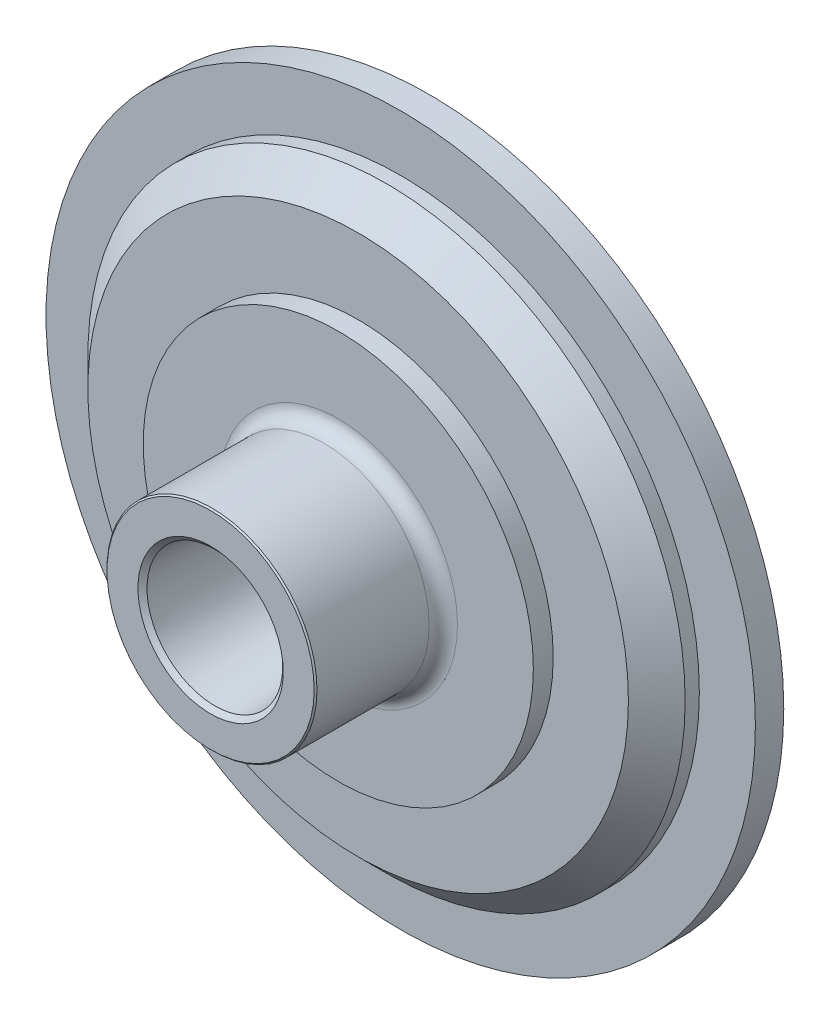
ISO-10303-21;
HEADER;
FILE_DESCRIPTION(('STEP AP214'),'2;1');
FILE_NAME('part.step','',(''),(''),'','','');
FILE_SCHEMA(('AUTOMOTIVE_DESIGN { 1 0 10303 214 1 1 1 1 }'));
ENDSEC;
DATA;
#1=APPLICATION_CONTEXT('core data for automotive mechanical design processes');
#2=APPLICATION_PROTOCOL_DEFINITION('international standard','automotive_design',2000,#1);
#3=PRODUCT_CONTEXT('',#1,'mechanical');
#4=PRODUCT('Part','Part','',(#3));
#5=PRODUCT_RELATED_PRODUCT_CATEGORY('part','',(#4));
#6=PRODUCT_DEFINITION_FORMATION('','',#4);
#7=PRODUCT_DEFINITION_CONTEXT('part definition',#1,'design');
#8=PRODUCT_DEFINITION('design','',#6,#7);
#9=PRODUCT_DEFINITION_SHAPE('','',#8);
#10=(LENGTH_UNIT() NAMED_UNIT(*) SI_UNIT(.MILLI.,.METRE.));
#11=(NAMED_UNIT(*) PLANE_ANGLE_UNIT() SI_UNIT($,.RADIAN.));
#12=(NAMED_UNIT(*) SI_UNIT($,.STERADIAN.) SOLID_ANGLE_UNIT());
#13=UNCERTAINTY_MEASURE_WITH_UNIT(LENGTH_MEASURE(1.E-05),#10,'distance_accuracy_value','');
#14=(GEOMETRIC_REPRESENTATION_CONTEXT(3) GLOBAL_UNCERTAINTY_ASSIGNED_CONTEXT((#13)) GLOBAL_UNIT_ASSIGNED_CONTEXT((#10,
#11,#12)) REPRESENTATION_CONTEXT('',''));
#15=CARTESIAN_POINT('',(0.,0.,0.));
#16=DIRECTION('',(0.,0.,1.));
#17=DIRECTION('',(1.,0.,0.));
#18=AXIS2_PLACEMENT_3D('',#15,#16,#17);
#19=CARTESIAN_POINT('',(0.,35.,-65.4818552334935));
#20=DIRECTION('',(0.,0.,1.));
#21=DIRECTION('',(1.,0.,0.));
#22=AXIS2_PLACEMENT_3D('',#19,#20,#21);
#23=PLANE('',#22);
#24=CARTESIAN_POINT('',(0.,0.,-65.4818552334935));
#25=DIRECTION('',(0.,0.,1.));
#26=DIRECTION('',(1.,0.,0.));
#27=AXIS2_PLACEMENT_3D('',#24,#25,#26);
#28=CIRCLE('',#27,35.);
#29=CARTESIAN_POINT('',(35.,0.,-65.4818552334935));
#30=VERTEX_POINT('',#29);
#31=EDGE_CURVE('E130',#30,#30,#28,.T.);
#32=ORIENTED_EDGE('',*,*,#31,.F.);
#33=EDGE_LOOP('',(#32));
#34=FACE_BOUND('',#33,.T.);
#35=CARTESIAN_POINT('',(0.,0.,-65.4818552334935));
#36=DIRECTION('',(0.,0.,1.));
#37=DIRECTION('',(1.,0.,0.));
#38=AXIS2_PLACEMENT_3D('',#35,#36,#37);
#39=CIRCLE('',#38,20.76);
#40=CARTESIAN_POINT('',(20.76,0.,-65.4818552334935));
#41=VERTEX_POINT('',#40);
#42=EDGE_CURVE('E10',#41,#41,#39,.T.);
#43=ORIENTED_EDGE('',*,*,#42,.T.);
#44=EDGE_LOOP('',(#43));
#45=FACE_BOUND('',#44,.T.);
#46=ADVANCED_FACE('F39',(#34,#45),#23,.F.);
#47=CARTESIAN_POINT('',(0.,0.,-15.9788373758317));
#48=DIRECTION('',(0.,0.,1.));
#49=DIRECTION('',(1.,0.,0.));
#50=AXIS2_PLACEMENT_3D('',#47,#48,#49);
#51=CONICAL_SURFACE('',#50,23.904897605075,0.0634441501961792);
#52=ORIENTED_EDGE('',*,*,#42,.F.);
#53=EDGE_LOOP('',(#52));
#54=FACE_BOUND('',#53,.T.);
#55=CARTESIAN_POINT('',(0.,0.,-15.9788373758317));
#56=DIRECTION('',(0.,0.,1.));
#57=DIRECTION('',(1.,0.,0.));
#58=AXIS2_PLACEMENT_3D('',#55,#56,#57);
#59=CIRCLE('',#58,23.904897605075);
#60=CARTESIAN_POINT('',(23.904897605075,0.,-15.9788373758317));
#61=VERTEX_POINT('',#60);
#62=EDGE_CURVE('E46',#61,#61,#59,.T.);
#63=ORIENTED_EDGE('',*,*,#62,.T.);
#64=EDGE_LOOP('',(#63));
#65=FACE_BOUND('',#64,.T.);
#66=ADVANCED_FACE('F138',(#54,#65),#51,.F.);
#67=CARTESIAN_POINT('',(0.,0.,-14.4818552334935));
#68=DIRECTION('',(0.,0.,1.));
#69=DIRECTION('',(1.,0.,0.));
#70=AXIS2_PLACEMENT_3D('',#67,#68,#69);
#71=CONICAL_SURFACE('',#70,25.6049878772782,0.848842313593626);
#72=ORIENTED_EDGE('',*,*,#62,.F.);
#73=EDGE_LOOP('',(#72));
#74=FACE_BOUND('',#73,.T.);
#75=CARTESIAN_POINT('',(0.,0.,-14.4818552334935));
#76=DIRECTION('',(0.,0.,1.));
#77=DIRECTION('',(1.,0.,0.));
#78=AXIS2_PLACEMENT_3D('',#75,#76,#77);
#79=CIRCLE('',#78,25.6049878772782);
#80=CARTESIAN_POINT('',(25.6049878772782,0.,-14.4818552334935));
#81=VERTEX_POINT('',#80);
#82=EDGE_CURVE('E51',#81,#81,#79,.T.);
#83=ORIENTED_EDGE('',*,*,#82,.T.);
#84=EDGE_LOOP('',(#83));
#85=FACE_BOUND('',#84,.T.);
#86=ADVANCED_FACE('F142',(#74,#85),#71,.F.);
#87=CARTESIAN_POINT('',(0.,25.6049878772782,-14.4818552334935));
#88=DIRECTION('',(0.,0.,-1.));
#89=DIRECTION('',(-1.,0.,0.));
#90=AXIS2_PLACEMENT_3D('',#87,#88,#89);
#91=PLANE('',#90);
#92=ORIENTED_EDGE('',*,*,#82,.F.);
#93=EDGE_LOOP('',(#92));
#94=FACE_BOUND('',#93,.T.);
#95=CARTESIAN_POINT('',(0.,0.,-14.4818552334935));
#96=DIRECTION('',(0.,0.,1.));
#97=DIRECTION('',(1.,0.,0.));
#98=AXIS2_PLACEMENT_3D('',#95,#96,#97);
#99=CIRCLE('',#98,36.5);
#100=CARTESIAN_POINT('',(36.5,0.,-14.4818552334935));
#101=VERTEX_POINT('',#100);
#102=EDGE_CURVE('E56',#101,#101,#99,.T.);
#103=ORIENTED_EDGE('',*,*,#102,.T.);
#104=EDGE_LOOP('',(#103));
#105=FACE_BOUND('',#104,.T.);
#106=ADVANCED_FACE('F147',(#94,#105),#91,.F.);
#107=CARTESIAN_POINT('',(0.,0.,-14.9818552334935));
#108=DIRECTION('',(0.,0.,-1.));
#109=DIRECTION('',(-1.,0.,0.));
#110=AXIS2_PLACEMENT_3D('',#107,#108,#109);
#111=CONICAL_SURFACE('',#110,37.,0.785398163397462);
#112=ORIENTED_EDGE('',*,*,#102,.F.);
#113=EDGE_LOOP('',(#112));
#114=FACE_BOUND('',#113,.T.);
#115=CARTESIAN_POINT('',(0.,0.,-14.9818552334935));
#116=DIRECTION('',(0.,0.,1.));
#117=DIRECTION('',(1.,0.,0.));
#118=AXIS2_PLACEMENT_3D('',#115,#116,#117);
#119=CIRCLE('',#118,37.);
#120=CARTESIAN_POINT('',(37.,0.,-14.9818552334935));
#121=VERTEX_POINT('',#120);
#122=EDGE_CURVE('E62',#121,#121,#119,.T.);
#123=ORIENTED_EDGE('',*,*,#122,.T.);
#124=EDGE_LOOP('',(#123));
#125=FACE_BOUND('',#124,.T.);
#126=ADVANCED_FACE('F153',(#114,#125),#111,.T.);
#127=CARTESIAN_POINT('',(0.,0.,-5.28155086198055));
#128=DIRECTION('',(0.,0.,1.));
#129=DIRECTION('',(1.,0.,0.));
#130=AXIS2_PLACEMENT_3D('',#127,#128,#129);
#131=CYLINDRICAL_SURFACE('',#130,37.);
#132=ORIENTED_EDGE('',*,*,#122,.F.);
#133=EDGE_LOOP('',(#132));
#134=FACE_BOUND('',#133,.T.);
#135=CARTESIAN_POINT('',(0.,0.,-54.4818552334935));
#136=DIRECTION('',(0.,0.,1.));
#137=DIRECTION('',(1.,0.,0.));
#138=AXIS2_PLACEMENT_3D('',#135,#136,#137);
#139=CIRCLE('',#138,37.);
#140=CARTESIAN_POINT('',(37.,0.,-54.4818552334935));
#141=VERTEX_POINT('',#140);
#142=EDGE_CURVE('E66',#141,#141,#139,.T.);
#143=ORIENTED_EDGE('',*,*,#142,.T.);
#144=EDGE_LOOP('',(#143));
#145=FACE_BOUND('',#144,.T.);
#146=ADVANCED_FACE('F157',(#134,#145),#131,.T.);
#147=CARTESIAN_POINT('',(0.,0.,-54.4818552334935));
#148=DIRECTION('',(0.,0.,1.));
#149=DIRECTION('',(1.,0.,0.));
#150=AXIS2_PLACEMENT_3D('',#147,#148,#149);
#151=TOROIDAL_SURFACE('',#150,42.,5.);
#152=ORIENTED_EDGE('',*,*,#142,.F.);
#153=EDGE_LOOP('',(#152));
#154=FACE_BOUND('',#153,.T.);
#155=CARTESIAN_POINT('',(0.,0.,-59.4818552334935));
#156=DIRECTION('',(0.,0.,1.));
#157=DIRECTION('',(1.,0.,0.));
#158=AXIS2_PLACEMENT_3D('',#155,#156,#157);
#159=CIRCLE('',#158,42.);
#160=CARTESIAN_POINT('',(42.,0.,-59.4818552334935));
#161=VERTEX_POINT('',#160);
#162=EDGE_CURVE('E70',#161,#161,#159,.T.);
#163=ORIENTED_EDGE('',*,*,#162,.T.);
#164=EDGE_LOOP('',(#163));
#165=FACE_BOUND('',#164,.T.);
#166=ADVANCED_FACE('F161',(#154,#165),#151,.F.);
#167=CARTESIAN_POINT('',(0.,42.,-59.4818552334935));
#168=DIRECTION('',(0.,0.,-1.));
#169=DIRECTION('',(-1.,0.,0.));
#170=AXIS2_PLACEMENT_3D('',#167,#168,#169);
#171=PLANE('',#170);
#172=ORIENTED_EDGE('',*,*,#162,.F.);
#173=EDGE_LOOP('',(#172));
#174=FACE_BOUND('',#173,.T.);
#175=CARTESIAN_POINT('',(0.,0.,-59.4818552334935));
#176=DIRECTION('',(0.,0.,1.));
#177=DIRECTION('',(1.,0.,0.));
#178=AXIS2_PLACEMENT_3D('',#175,#176,#177);
#179=CIRCLE('',#178,68.75);
#180=CARTESIAN_POINT('',(68.75,0.,-59.4818552334935));
#181=VERTEX_POINT('',#180);
#182=EDGE_CURVE('E74',#181,#181,#179,.T.);
#183=ORIENTED_EDGE('',*,*,#182,.T.);
#184=EDGE_LOOP('',(#183));
#185=FACE_BOUND('',#184,.T.);
#186=ADVANCED_FACE('F165',(#174,#185),#171,.F.);
#187=CARTESIAN_POINT('',(0.,0.,-5.28155086198055));
#188=DIRECTION('',(0.,0.,1.));
#189=DIRECTION('',(1.,0.,0.));
#190=AXIS2_PLACEMENT_3D('',#187,#188,#189);
#191=CYLINDRICAL_SURFACE('',#190,68.75);
#192=ORIENTED_EDGE('',*,*,#182,.F.);
#193=EDGE_LOOP('',(#192));
#194=FACE_BOUND('',#193,.T.);
#195=CARTESIAN_POINT('',(0.,0.,-66.4818552334935));
#196=DIRECTION('',(0.,0.,1.));
#197=DIRECTION('',(1.,0.,0.));
#198=AXIS2_PLACEMENT_3D('',#195,#196,#197);
#199=CIRCLE('',#198,68.75);
#200=CARTESIAN_POINT('',(68.75,0.,-66.4818552334935));
#201=VERTEX_POINT('',#200);
#202=EDGE_CURVE('E78',#201,#201,#199,.T.);
#203=ORIENTED_EDGE('',*,*,#202,.T.);
#204=EDGE_LOOP('',(#203));
#205=FACE_BOUND('',#204,.T.);
#206=ADVANCED_FACE('F169',(#194,#205),#191,.T.);
#207=CARTESIAN_POINT('',(0.,68.75,-66.4818552334935));
#208=DIRECTION('',(0.,0.,-1.));
#209=DIRECTION('',(-1.,0.,0.));
#210=AXIS2_PLACEMENT_3D('',#207,#208,#209);
#211=PLANE('',#210);
#212=ORIENTED_EDGE('',*,*,#202,.F.);
#213=EDGE_LOOP('',(#212));
#214=FACE_BOUND('',#213,.T.);
#215=CARTESIAN_POINT('',(0.,0.,-66.4818552334935));
#216=DIRECTION('',(0.,0.,1.));
#217=DIRECTION('',(1.,0.,0.));
#218=AXIS2_PLACEMENT_3D('',#215,#216,#217);
#219=CIRCLE('',#218,95.25);
#220=CARTESIAN_POINT('',(95.25,0.,-66.4818552334935));
#221=VERTEX_POINT('',#220);
#222=EDGE_CURVE('E82',#221,#221,#219,.T.);
#223=ORIENTED_EDGE('',*,*,#222,.T.);
#224=EDGE_LOOP('',(#223));
#225=FACE_BOUND('',#224,.T.);
#226=ADVANCED_FACE('F173',(#214,#225),#211,.F.);
#227=CARTESIAN_POINT('',(0.,0.,-76.4818552334935));
#228=DIRECTION('',(0.,0.,-1.));
#229=DIRECTION('',(-1.,0.,0.));
#230=AXIS2_PLACEMENT_3D('',#227,#228,#229);
#231=CONICAL_SURFACE('',#230,105.25,0.78539816339745);
#232=ORIENTED_EDGE('',*,*,#222,.F.);
#233=EDGE_LOOP('',(#232));
#234=FACE_BOUND('',#233,.T.);
#235=CARTESIAN_POINT('',(0.,0.,-76.4818552334935));
#236=DIRECTION('',(0.,0.,1.));
#237=DIRECTION('',(1.,0.,0.));
#238=AXIS2_PLACEMENT_3D('',#235,#236,#237);
#239=CIRCLE('',#238,105.25);
#240=CARTESIAN_POINT('',(105.25,0.,-76.4818552334935));
#241=VERTEX_POINT('',#240);
#242=EDGE_CURVE('E86',#241,#241,#239,.T.);
#243=ORIENTED_EDGE('',*,*,#242,.T.);
#244=EDGE_LOOP('',(#243));
#245=FACE_BOUND('',#244,.T.);
#246=ADVANCED_FACE('F177',(#234,#245),#231,.T.);
#247=CARTESIAN_POINT('',(0.,0.,-5.28155086198055));
#248=DIRECTION('',(0.,0.,1.));
#249=DIRECTION('',(1.,0.,0.));
#250=AXIS2_PLACEMENT_3D('',#247,#248,#249);
#251=CYLINDRICAL_SURFACE('',#250,105.25);
#252=ORIENTED_EDGE('',*,*,#242,.F.);
#253=EDGE_LOOP('',(#252));
#254=FACE_BOUND('',#253,.T.);
#255=CARTESIAN_POINT('',(0.,0.,-81.4818552334935));
#256=DIRECTION('',(0.,0.,1.));
#257=DIRECTION('',(1.,0.,0.));
#258=AXIS2_PLACEMENT_3D('',#255,#256,#257);
#259=CIRCLE('',#258,105.25);
#260=CARTESIAN_POINT('',(105.25,0.,-81.4818552334935));
#261=VERTEX_POINT('',#260);
#262=EDGE_CURVE('E90',#261,#261,#259,.T.);
#263=ORIENTED_EDGE('',*,*,#262,.T.);
#264=EDGE_LOOP('',(#263));
#265=FACE_BOUND('',#264,.T.);
#266=ADVANCED_FACE('F181',(#254,#265),#251,.T.);
#267=CARTESIAN_POINT('',(0.,105.25,-81.4818552334935));
#268=DIRECTION('',(0.,0.,-1.));
#269=DIRECTION('',(-1.,0.,0.));
#270=AXIS2_PLACEMENT_3D('',#267,#268,#269);
#271=PLANE('',#270);
#272=ORIENTED_EDGE('',*,*,#262,.F.);
#273=EDGE_LOOP('',(#272));
#274=FACE_BOUND('',#273,.T.);
#275=CARTESIAN_POINT('',(0.,0.,-81.4818552334935));
#276=DIRECTION('',(0.,0.,1.));
#277=DIRECTION('',(1.,0.,0.));
#278=AXIS2_PLACEMENT_3D('',#275,#276,#277);
#279=CIRCLE('',#278,125.);
#280=CARTESIAN_POINT('',(125.,0.,-81.4818552334935));
#281=VERTEX_POINT('',#280);
#282=EDGE_CURVE('E94',#281,#281,#279,.T.);
#283=ORIENTED_EDGE('',*,*,#282,.T.);
#284=EDGE_LOOP('',(#283));
#285=FACE_BOUND('',#284,.T.);
#286=ADVANCED_FACE('F185',(#274,#285),#271,.F.);
#287=CARTESIAN_POINT('',(0.,0.,-5.28155086198055));
#288=DIRECTION('',(0.,0.,1.));
#289=DIRECTION('',(1.,0.,0.));
#290=AXIS2_PLACEMENT_3D('',#287,#288,#289);
#291=CYLINDRICAL_SURFACE('',#290,125.);
#292=ORIENTED_EDGE('',*,*,#282,.F.);
#293=EDGE_LOOP('',(#292));
#294=FACE_BOUND('',#293,.T.);
#295=CARTESIAN_POINT('',(0.,0.,-91.4818552334934));
#296=DIRECTION('',(0.,0.,1.));
#297=DIRECTION('',(1.,0.,0.));
#298=AXIS2_PLACEMENT_3D('',#295,#296,#297);
#299=CIRCLE('',#298,125.);
#300=CARTESIAN_POINT('',(125.,0.,-91.4818552334934));
#301=VERTEX_POINT('',#300);
#302=EDGE_CURVE('E98',#301,#301,#299,.T.);
#303=ORIENTED_EDGE('',*,*,#302,.T.);
#304=EDGE_LOOP('',(#303));
#305=FACE_BOUND('',#304,.T.);
#306=ADVANCED_FACE('F189',(#294,#305),#291,.T.);
#307=CARTESIAN_POINT('',(0.,125.,-91.4818552334934));
#308=DIRECTION('',(0.,0.,1.));
#309=DIRECTION('',(1.,0.,0.));
#310=AXIS2_PLACEMENT_3D('',#307,#308,#309);
#311=PLANE('',#310);
#312=ORIENTED_EDGE('',*,*,#302,.F.);
#313=EDGE_LOOP('',(#312));
#314=FACE_BOUND('',#313,.T.);
#315=CARTESIAN_POINT('',(0.,0.,-91.4818552334934));
#316=DIRECTION('',(0.,0.,1.));
#317=DIRECTION('',(1.,0.,0.));
#318=AXIS2_PLACEMENT_3D('',#315,#316,#317);
#319=CIRCLE('',#318,95.);
#320=CARTESIAN_POINT('',(95.,0.,-91.4818552334934));
#321=VERTEX_POINT('',#320);
#322=EDGE_CURVE('E102',#321,#321,#319,.T.);
#323=ORIENTED_EDGE('',*,*,#322,.T.);
#324=EDGE_LOOP('',(#323));
#325=FACE_BOUND('',#324,.T.);
#326=ADVANCED_FACE('F193',(#314,#325),#311,.F.);
#327=CARTESIAN_POINT('',(0.,0.,-5.28155086198055));
#328=DIRECTION('',(0.,0.,1.));
#329=DIRECTION('',(1.,0.,0.));
#330=AXIS2_PLACEMENT_3D('',#327,#328,#329);
#331=CYLINDRICAL_SURFACE('',#330,95.);
#332=ORIENTED_EDGE('',*,*,#322,.F.);
#333=EDGE_LOOP('',(#332));
#334=FACE_BOUND('',#333,.T.);
#335=CARTESIAN_POINT('',(0.,0.,-94.4818552334934));
#336=DIRECTION('',(0.,0.,1.));
#337=DIRECTION('',(1.,0.,0.));
#338=AXIS2_PLACEMENT_3D('',#335,#336,#337);
#339=CIRCLE('',#338,95.);
#340=CARTESIAN_POINT('',(95.,0.,-94.4818552334934));
#341=VERTEX_POINT('',#340);
#342=EDGE_CURVE('E106',#341,#341,#339,.T.);
#343=ORIENTED_EDGE('',*,*,#342,.T.);
#344=EDGE_LOOP('',(#343));
#345=FACE_BOUND('',#344,.T.);
#346=ADVANCED_FACE('F197',(#334,#345),#331,.T.);
#347=CARTESIAN_POINT('',(0.,95.,-94.4818552334934));
#348=DIRECTION('',(0.,0.,1.));
#349=DIRECTION('',(1.,0.,0.));
#350=AXIS2_PLACEMENT_3D('',#347,#348,#349);
#351=PLANE('',#350);
#352=ORIENTED_EDGE('',*,*,#342,.F.);
#353=EDGE_LOOP('',(#352));
#354=FACE_BOUND('',#353,.T.);
#355=CARTESIAN_POINT('',(0.,0.,-94.4818552334934));
#356=DIRECTION('',(0.,0.,1.));
#357=DIRECTION('',(1.,0.,0.));
#358=AXIS2_PLACEMENT_3D('',#355,#356,#357);
#359=CIRCLE('',#358,90.);
#360=CARTESIAN_POINT('',(90.,0.,-94.4818552334934));
#361=VERTEX_POINT('',#360);
#362=EDGE_CURVE('E110',#361,#361,#359,.T.);
#363=ORIENTED_EDGE('',*,*,#362,.T.);
#364=EDGE_LOOP('',(#363));
#365=FACE_BOUND('',#364,.T.);
#366=ADVANCED_FACE('F201',(#354,#365),#351,.F.);
#367=CARTESIAN_POINT('',(0.,0.,-5.28155086198055));
#368=DIRECTION('',(0.,0.,1.));
#369=DIRECTION('',(1.,0.,0.));
#370=AXIS2_PLACEMENT_3D('',#367,#368,#369);
#371=CYLINDRICAL_SURFACE('',#370,90.);
#372=ORIENTED_EDGE('',*,*,#362,.F.);
#373=EDGE_LOOP('',(#372));
#374=FACE_BOUND('',#373,.T.);
#375=CARTESIAN_POINT('',(0.,0.,-79.4818552334934));
#376=DIRECTION('',(0.,0.,1.));
#377=DIRECTION('',(1.,0.,0.));
#378=AXIS2_PLACEMENT_3D('',#375,#376,#377);
#379=CIRCLE('',#378,90.);
#380=CARTESIAN_POINT('',(90.,0.,-79.4818552334934));
#381=VERTEX_POINT('',#380);
#382=EDGE_CURVE('E114',#381,#381,#379,.T.);
#383=ORIENTED_EDGE('',*,*,#382,.T.);
#384=EDGE_LOOP('',(#383));
#385=FACE_BOUND('',#384,.T.);
#386=ADVANCED_FACE('F205',(#374,#385),#371,.F.);
#387=CARTESIAN_POINT('',(0.,90.,-79.4818552334934));
#388=DIRECTION('',(0.,0.,1.));
#389=DIRECTION('',(1.,0.,0.));
#390=AXIS2_PLACEMENT_3D('',#387,#388,#389);
#391=PLANE('',#390);
#392=ORIENTED_EDGE('',*,*,#382,.F.);
#393=EDGE_LOOP('',(#392));
#394=FACE_BOUND('',#393,.T.);
#395=CARTESIAN_POINT('',(0.,0.,-79.4818552334934));
#396=DIRECTION('',(0.,0.,1.));
#397=DIRECTION('',(1.,0.,0.));
#398=AXIS2_PLACEMENT_3D('',#395,#396,#397);
#399=CIRCLE('',#398,66.15);
#400=CARTESIAN_POINT('',(66.15,0.,-79.4818552334934));
#401=VERTEX_POINT('',#400);
#402=EDGE_CURVE('E118',#401,#401,#399,.T.);
#403=ORIENTED_EDGE('',*,*,#402,.T.);
#404=EDGE_LOOP('',(#403));
#405=FACE_BOUND('',#404,.T.);
#406=ADVANCED_FACE('F209',(#394,#405),#391,.F.);
#407=CARTESIAN_POINT('',(0.,0.,-5.28155086198055));
#408=DIRECTION('',(0.,0.,1.));
#409=DIRECTION('',(1.,0.,0.));
#410=AXIS2_PLACEMENT_3D('',#407,#408,#409);
#411=CYLINDRICAL_SURFACE('',#410,66.15);
#412=ORIENTED_EDGE('',*,*,#402,.F.);
#413=EDGE_LOOP('',(#412));
#414=FACE_BOUND('',#413,.T.);
#415=CARTESIAN_POINT('',(0.,0.,-75.9818552334934));
#416=DIRECTION('',(0.,0.,1.));
#417=DIRECTION('',(1.,0.,0.));
#418=AXIS2_PLACEMENT_3D('',#415,#416,#417);
#419=CIRCLE('',#418,66.15);
#420=CARTESIAN_POINT('',(66.15,0.,-75.9818552334934));
#421=VERTEX_POINT('',#420);
#422=EDGE_CURVE('E122',#421,#421,#419,.T.);
#423=ORIENTED_EDGE('',*,*,#422,.T.);
#424=EDGE_LOOP('',(#423));
#425=FACE_BOUND('',#424,.T.);
#426=ADVANCED_FACE('F213',(#414,#425),#411,.F.);
#427=CARTESIAN_POINT('',(0.,66.15,-75.9818552334934));
#428=DIRECTION('',(0.,0.,1.));
#429=DIRECTION('',(1.,0.,0.));
#430=AXIS2_PLACEMENT_3D('',#427,#428,#429);
#431=PLANE('',#430);
#432=ORIENTED_EDGE('',*,*,#422,.F.);
#433=EDGE_LOOP('',(#432));
#434=FACE_BOUND('',#433,.T.);
#435=CARTESIAN_POINT('',(0.,0.,-75.9818552334934));
#436=DIRECTION('',(0.,0.,1.));
#437=DIRECTION('',(1.,0.,0.));
#438=AXIS2_PLACEMENT_3D('',#435,#436,#437);
#439=CIRCLE('',#438,53.1865334794731);
#440=CARTESIAN_POINT('',(53.1865334794731,0.,-75.9818552334934));
#441=VERTEX_POINT('',#440);
#442=EDGE_CURVE('E126',#441,#441,#439,.T.);
#443=ORIENTED_EDGE('',*,*,#442,.T.);
#444=EDGE_LOOP('',(#443));
#445=FACE_BOUND('',#444,.T.);
#446=ADVANCED_FACE('F217',(#434,#445),#431,.F.);
#447=CARTESIAN_POINT('',(0.,0.,-65.4818552334935));
#448=DIRECTION('',(0.,0.,-1.));
#449=DIRECTION('',(-1.,0.,0.));
#450=AXIS2_PLACEMENT_3D('',#447,#448,#449);
#451=CONICAL_SURFACE('',#450,35.,1.0471975511966);
#452=ORIENTED_EDGE('',*,*,#442,.F.);
#453=EDGE_LOOP('',(#452));
#454=FACE_BOUND('',#453,.T.);
#455=ORIENTED_EDGE('',*,*,#31,.T.);
#456=EDGE_LOOP('',(#455));
#457=FACE_BOUND('',#456,.T.);
#458=ADVANCED_FACE('F135',(#454,#457),#451,.F.);
#459=CLOSED_SHELL('',(#46,#66,#86,#106,#126,#146,#166,#186,#206,#226,#246,#266,#286,#306,#326,
#346,#366,#386,#406,#426,#446,#458));
#460=MANIFOLD_SOLID_BREP('B2',#459);
#461=ADVANCED_BREP_SHAPE_REPRESENTATION('',(#18,#460),#14);
#462=SHAPE_DEFINITION_REPRESENTATION(#9,#461);
ENDSEC;
END-ISO-10303-21;
